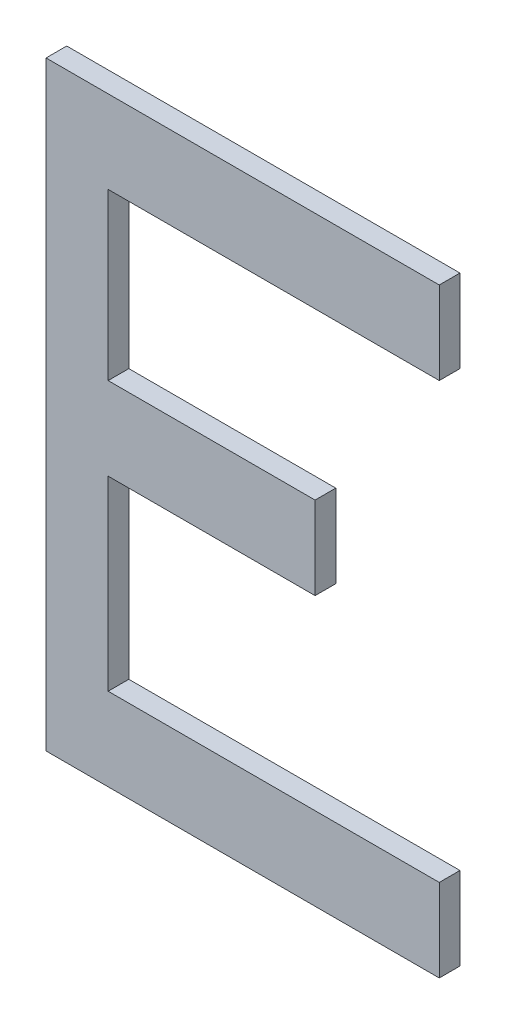
ISO-10303-21;
HEADER;
FILE_DESCRIPTION(('STEP AP214'),'2;1');
FILE_NAME('part.step','',(''),(''),'','','');
FILE_SCHEMA(('AUTOMOTIVE_DESIGN { 1 0 10303 214 1 1 1 1 }'));
ENDSEC;
DATA;
#1=APPLICATION_CONTEXT('core data for automotive mechanical design processes');
#2=APPLICATION_PROTOCOL_DEFINITION('international standard','automotive_design',2000,#1);
#3=PRODUCT_CONTEXT('',#1,'mechanical');
#4=PRODUCT('Part','Part','',(#3));
#5=PRODUCT_RELATED_PRODUCT_CATEGORY('part','',(#4));
#6=PRODUCT_DEFINITION_FORMATION('','',#4);
#7=PRODUCT_DEFINITION_CONTEXT('part definition',#1,'design');
#8=PRODUCT_DEFINITION('design','',#6,#7);
#9=PRODUCT_DEFINITION_SHAPE('','',#8);
#10=(LENGTH_UNIT() NAMED_UNIT(*) SI_UNIT(.MILLI.,.METRE.));
#11=(NAMED_UNIT(*) PLANE_ANGLE_UNIT() SI_UNIT($,.RADIAN.));
#12=(NAMED_UNIT(*) SI_UNIT($,.STERADIAN.) SOLID_ANGLE_UNIT());
#13=UNCERTAINTY_MEASURE_WITH_UNIT(LENGTH_MEASURE(1.E-05),#10,'distance_accuracy_value','');
#14=(GEOMETRIC_REPRESENTATION_CONTEXT(3) GLOBAL_UNCERTAINTY_ASSIGNED_CONTEXT((#13)) GLOBAL_UNIT_ASSIGNED_CONTEXT((#10,
#11,#12)) REPRESENTATION_CONTEXT('',''));
#15=CARTESIAN_POINT('',(0.,0.,0.));
#16=DIRECTION('',(0.,0.,1.));
#17=DIRECTION('',(1.,0.,0.));
#18=AXIS2_PLACEMENT_3D('',#15,#16,#17);
#19=CARTESIAN_POINT('',(-0.09499853999999,0.14500098,0.01));
#20=DIRECTION('',(0.,0.,1.));
#21=DIRECTION('',(1.,0.,0.));
#22=AXIS2_PLACEMENT_3D('',#19,#20,#21);
#23=PLANE('',#22);
#24=DIRECTION('',(0.,1.,0.));
#25=VECTOR('',#24,1.);
#26=CARTESIAN_POINT('',(0.09500108,0.14500098,0.01));
#27=LINE('',#26,#25);
#28=CARTESIAN_POINT('',(0.09500108,0.14500098,0.01));
#29=VERTEX_POINT('',#28);
#30=CARTESIAN_POINT('',(0.09500108,0.10500106,0.01));
#31=VERTEX_POINT('',#30);
#32=EDGE_CURVE('E156',#29,#31,#27,.F.);
#33=ORIENTED_EDGE('',*,*,#32,.F.);
#34=DIRECTION('',(1.,0.,0.));
#35=VECTOR('',#34,1.);
#36=CARTESIAN_POINT('',(-0.09499853999999,0.14500098,0.01));
#37=LINE('',#36,#35);
#38=CARTESIAN_POINT('',(-0.09499853999999,0.14500098,0.01));
#39=VERTEX_POINT('',#38);
#40=EDGE_CURVE('E117',#39,#29,#37,.T.);
#41=ORIENTED_EDGE('',*,*,#40,.F.);
#42=DIRECTION('',(0.,1.,0.));
#43=VECTOR('',#42,1.);
#44=CARTESIAN_POINT('',(-0.09499853999999,-0.14499844,0.01));
#45=LINE('',#44,#43);
#46=CARTESIAN_POINT('',(-0.09499853999999,-0.14499844,0.01));
#47=VERTEX_POINT('',#46);
#48=EDGE_CURVE('E19',#47,#39,#45,.T.);
#49=ORIENTED_EDGE('',*,*,#48,.F.);
#50=DIRECTION('',(1.,0.,0.));
#51=VECTOR('',#50,1.);
#52=CARTESIAN_POINT('',(0.09500108,-0.14499844,0.01));
#53=LINE('',#52,#51);
#54=CARTESIAN_POINT('',(0.09500108,-0.14499844,0.01));
#55=VERTEX_POINT('',#54);
#56=EDGE_CURVE('E106',#55,#47,#53,.F.);
#57=ORIENTED_EDGE('',*,*,#56,.F.);
#58=DIRECTION('',(0.,1.,0.));
#59=VECTOR('',#58,1.);
#60=CARTESIAN_POINT('',(0.09500108,-0.10499852,0.01));
#61=LINE('',#60,#59);
#62=CARTESIAN_POINT('',(0.09500108,-0.10499852,0.01));
#63=VERTEX_POINT('',#62);
#64=EDGE_CURVE('E101',#63,#55,#61,.F.);
#65=ORIENTED_EDGE('',*,*,#64,.F.);
#66=DIRECTION('',(1.,0.,0.));
#67=VECTOR('',#66,1.);
#68=CARTESIAN_POINT('',(-0.0649986,-0.10499852,0.01));
#69=LINE('',#68,#67);
#70=CARTESIAN_POINT('',(-0.0649986,-0.10499852,0.01));
#71=VERTEX_POINT('',#70);
#72=EDGE_CURVE('E128',#71,#63,#69,.T.);
#73=ORIENTED_EDGE('',*,*,#72,.F.);
#74=DIRECTION('',(0.,1.,0.));
#75=VECTOR('',#74,1.);
#76=CARTESIAN_POINT('',(-0.0649986,-0.01499869999999,0.01));
#77=LINE('',#76,#75);
#78=CARTESIAN_POINT('',(-0.0649986,-0.01499869999999,0.01));
#79=VERTEX_POINT('',#78);
#80=EDGE_CURVE('E132',#79,#71,#77,.F.);
#81=ORIENTED_EDGE('',*,*,#80,.F.);
#82=DIRECTION('',(1.,0.,0.));
#83=VECTOR('',#82,1.);
#84=CARTESIAN_POINT('',(0.0350012,-0.01499869999999,0.01));
#85=LINE('',#84,#83);
#86=CARTESIAN_POINT('',(0.0350012,-0.01499869999999,0.01));
#87=VERTEX_POINT('',#86);
#88=EDGE_CURVE('E136',#87,#79,#85,.F.);
#89=ORIENTED_EDGE('',*,*,#88,.F.);
#90=DIRECTION('',(0.,1.,0.));
#91=VECTOR('',#90,1.);
#92=CARTESIAN_POINT('',(0.0350012,0.02500122000001,0.01));
#93=LINE('',#92,#91);
#94=CARTESIAN_POINT('',(0.0350012,0.02500122000001,0.01));
#95=VERTEX_POINT('',#94);
#96=EDGE_CURVE('E140',#95,#87,#93,.F.);
#97=ORIENTED_EDGE('',*,*,#96,.F.);
#98=DIRECTION('',(1.,0.,0.));
#99=VECTOR('',#98,1.);
#100=CARTESIAN_POINT('',(-0.0649986,0.02500122000001,0.01));
#101=LINE('',#100,#99);
#102=CARTESIAN_POINT('',(-0.0649986,0.02500122000001,0.01));
#103=VERTEX_POINT('',#102);
#104=EDGE_CURVE('E144',#103,#95,#101,.T.);
#105=ORIENTED_EDGE('',*,*,#104,.F.);
#106=DIRECTION('',(0.,1.,0.));
#107=VECTOR('',#106,1.);
#108=CARTESIAN_POINT('',(-0.0649986,0.10500106,0.01));
#109=LINE('',#108,#107);
#110=CARTESIAN_POINT('',(-0.0649986,0.10500106,0.01));
#111=VERTEX_POINT('',#110);
#112=EDGE_CURVE('E148',#111,#103,#109,.F.);
#113=ORIENTED_EDGE('',*,*,#112,.F.);
#114=DIRECTION('',(1.,0.,0.));
#115=VECTOR('',#114,1.);
#116=CARTESIAN_POINT('',(0.09500108,0.10500106,0.01));
#117=LINE('',#116,#115);
#118=EDGE_CURVE('E152',#31,#111,#117,.F.);
#119=ORIENTED_EDGE('',*,*,#118,.F.);
#120=EDGE_LOOP('',(#33,#41,#49,#57,#65,#73,#81,#89,#97,#105,#113,#119));
#121=FACE_BOUND('',#120,.T.);
#122=ADVANCED_FACE('F16',(#121),#23,.T.);
#123=CARTESIAN_POINT('',(-0.09499853999999,-0.14499844,0.));
#124=DIRECTION('',(-1.,0.,0.));
#125=DIRECTION('',(0.,0.,1.));
#126=AXIS2_PLACEMENT_3D('',#123,#124,#125);
#127=PLANE('',#126);
#128=DIRECTION('',(0.,0.,1.));
#129=VECTOR('',#128,1.);
#130=CARTESIAN_POINT('',(-0.09499853999999,0.14500098,0.));
#131=LINE('',#130,#129);
#132=CARTESIAN_POINT('',(-0.09499853999999,0.14500098,0.));
#133=VERTEX_POINT('',#132);
#134=EDGE_CURVE('E160',#133,#39,#131,.T.);
#135=ORIENTED_EDGE('',*,*,#134,.F.);
#136=DIRECTION('',(0.,1.,0.));
#137=VECTOR('',#136,1.);
#138=CARTESIAN_POINT('',(-0.09499853999999,0.14500098,0.));
#139=LINE('',#138,#137);
#140=CARTESIAN_POINT('',(-0.09499853999999,-0.14499844,0.));
#141=VERTEX_POINT('',#140);
#142=EDGE_CURVE('E123',#133,#141,#139,.F.);
#143=ORIENTED_EDGE('',*,*,#142,.T.);
#144=DIRECTION('',(0.,0.,-1.));
#145=VECTOR('',#144,1.);
#146=CARTESIAN_POINT('',(-0.09499853999999,-0.14499844,0.));
#147=LINE('',#146,#145);
#148=EDGE_CURVE('E111',#47,#141,#147,.T.);
#149=ORIENTED_EDGE('',*,*,#148,.F.);
#150=ORIENTED_EDGE('',*,*,#48,.T.);
#151=EDGE_LOOP('',(#135,#143,#149,#150));
#152=FACE_BOUND('',#151,.T.);
#153=ADVANCED_FACE('F122',(#152),#127,.T.);
#154=CARTESIAN_POINT('',(0.09500108,-0.14499844,0.));
#155=DIRECTION('',(0.,-1.,0.));
#156=DIRECTION('',(0.,0.,-1.));
#157=AXIS2_PLACEMENT_3D('',#154,#155,#156);
#158=PLANE('',#157);
#159=ORIENTED_EDGE('',*,*,#148,.T.);
#160=DIRECTION('',(1.,0.,0.));
#161=VECTOR('',#160,1.);
#162=CARTESIAN_POINT('',(-0.09499853999999,-0.14499844,0.));
#163=LINE('',#162,#161);
#164=CARTESIAN_POINT('',(0.09500108,-0.14499844,0.));
#165=VERTEX_POINT('',#164);
#166=EDGE_CURVE('E165',#141,#165,#163,.T.);
#167=ORIENTED_EDGE('',*,*,#166,.T.);
#168=DIRECTION('',(0.,0.,-1.));
#169=VECTOR('',#168,1.);
#170=CARTESIAN_POINT('',(0.09500108,-0.14499844,0.));
#171=LINE('',#170,#169);
#172=EDGE_CURVE('E113',#55,#165,#171,.T.);
#173=ORIENTED_EDGE('',*,*,#172,.F.);
#174=ORIENTED_EDGE('',*,*,#56,.T.);
#175=EDGE_LOOP('',(#159,#167,#173,#174));
#176=FACE_BOUND('',#175,.T.);
#177=ADVANCED_FACE('F108',(#176),#158,.T.);
#178=CARTESIAN_POINT('',(0.09500108,-0.10499852,0.));
#179=DIRECTION('',(1.,0.,0.));
#180=DIRECTION('',(0.,0.,-1.));
#181=AXIS2_PLACEMENT_3D('',#178,#179,#180);
#182=PLANE('',#181);
#183=ORIENTED_EDGE('',*,*,#172,.T.);
#184=DIRECTION('',(0.,1.,0.));
#185=VECTOR('',#184,1.);
#186=CARTESIAN_POINT('',(0.09500108,0.14500098,0.));
#187=LINE('',#186,#185);
#188=CARTESIAN_POINT('',(0.09500108,-0.10499852,0.));
#189=VERTEX_POINT('',#188);
#190=EDGE_CURVE('E167',#165,#189,#187,.T.);
#191=ORIENTED_EDGE('',*,*,#190,.T.);
#192=DIRECTION('',(0.,0.,1.));
#193=VECTOR('',#192,1.);
#194=CARTESIAN_POINT('',(0.09500108,-0.10499852,0.));
#195=LINE('',#194,#193);
#196=EDGE_CURVE('E130',#63,#189,#195,.F.);
#197=ORIENTED_EDGE('',*,*,#196,.F.);
#198=ORIENTED_EDGE('',*,*,#64,.T.);
#199=EDGE_LOOP('',(#183,#191,#197,#198));
#200=FACE_BOUND('',#199,.T.);
#201=ADVANCED_FACE('F233',(#200),#182,.T.);
#202=CARTESIAN_POINT('',(-0.0649986,-0.10499852,0.));
#203=DIRECTION('',(0.,1.,0.));
#204=DIRECTION('',(0.,0.,1.));
#205=AXIS2_PLACEMENT_3D('',#202,#203,#204);
#206=PLANE('',#205);
#207=ORIENTED_EDGE('',*,*,#196,.T.);
#208=DIRECTION('',(1.,0.,0.));
#209=VECTOR('',#208,1.);
#210=CARTESIAN_POINT('',(-0.09499853999999,-0.10499852,0.));
#211=LINE('',#210,#209);
#212=CARTESIAN_POINT('',(-0.0649986,-0.10499852,0.));
#213=VERTEX_POINT('',#212);
#214=EDGE_CURVE('E170',#189,#213,#211,.F.);
#215=ORIENTED_EDGE('',*,*,#214,.T.);
#216=DIRECTION('',(0.,0.,-1.));
#217=VECTOR('',#216,1.);
#218=CARTESIAN_POINT('',(-0.0649986,-0.10499852,0.));
#219=LINE('',#218,#217);
#220=EDGE_CURVE('E134',#71,#213,#219,.T.);
#221=ORIENTED_EDGE('',*,*,#220,.F.);
#222=ORIENTED_EDGE('',*,*,#72,.T.);
#223=EDGE_LOOP('',(#207,#215,#221,#222));
#224=FACE_BOUND('',#223,.T.);
#225=ADVANCED_FACE('F232',(#224),#206,.T.);
#226=CARTESIAN_POINT('',(-0.0649986,-0.01499869999999,0.));
#227=DIRECTION('',(1.,0.,0.));
#228=DIRECTION('',(0.,0.,-1.));
#229=AXIS2_PLACEMENT_3D('',#226,#227,#228);
#230=PLANE('',#229);
#231=ORIENTED_EDGE('',*,*,#220,.T.);
#232=DIRECTION('',(0.,1.,0.));
#233=VECTOR('',#232,1.);
#234=CARTESIAN_POINT('',(-0.0649986,0.14500098,0.));
#235=LINE('',#234,#233);
#236=CARTESIAN_POINT('',(-0.0649986,-0.01499869999999,0.));
#237=VERTEX_POINT('',#236);
#238=EDGE_CURVE('E173',#213,#237,#235,.T.);
#239=ORIENTED_EDGE('',*,*,#238,.T.);
#240=DIRECTION('',(0.,0.,-1.));
#241=VECTOR('',#240,1.);
#242=CARTESIAN_POINT('',(-0.0649986,-0.01499869999999,0.));
#243=LINE('',#242,#241);
#244=EDGE_CURVE('E138',#79,#237,#243,.T.);
#245=ORIENTED_EDGE('',*,*,#244,.F.);
#246=ORIENTED_EDGE('',*,*,#80,.T.);
#247=EDGE_LOOP('',(#231,#239,#245,#246));
#248=FACE_BOUND('',#247,.T.);
#249=ADVANCED_FACE('F226',(#248),#230,.T.);
#250=CARTESIAN_POINT('',(0.0350012,-0.01499869999999,0.));
#251=DIRECTION('',(0.,-1.,0.));
#252=DIRECTION('',(0.,0.,-1.));
#253=AXIS2_PLACEMENT_3D('',#250,#251,#252);
#254=PLANE('',#253);
#255=ORIENTED_EDGE('',*,*,#244,.T.);
#256=DIRECTION('',(1.,0.,0.));
#257=VECTOR('',#256,1.);
#258=CARTESIAN_POINT('',(-0.09499853999999,-0.01499869999999,0.));
#259=LINE('',#258,#257);
#260=CARTESIAN_POINT('',(0.0350012,-0.01499869999999,0.));
#261=VERTEX_POINT('',#260);
#262=EDGE_CURVE('E176',#237,#261,#259,.T.);
#263=ORIENTED_EDGE('',*,*,#262,.T.);
#264=DIRECTION('',(0.,0.,-1.));
#265=VECTOR('',#264,1.);
#266=CARTESIAN_POINT('',(0.0350012,-0.01499869999999,0.));
#267=LINE('',#266,#265);
#268=EDGE_CURVE('E142',#87,#261,#267,.T.);
#269=ORIENTED_EDGE('',*,*,#268,.F.);
#270=ORIENTED_EDGE('',*,*,#88,.T.);
#271=EDGE_LOOP('',(#255,#263,#269,#270));
#272=FACE_BOUND('',#271,.T.);
#273=ADVANCED_FACE('F222',(#272),#254,.T.);
#274=CARTESIAN_POINT('',(0.0350012,0.02500122000001,0.));
#275=DIRECTION('',(1.,0.,0.));
#276=DIRECTION('',(0.,0.,-1.));
#277=AXIS2_PLACEMENT_3D('',#274,#275,#276);
#278=PLANE('',#277);
#279=ORIENTED_EDGE('',*,*,#268,.T.);
#280=DIRECTION('',(0.,1.,0.));
#281=VECTOR('',#280,1.);
#282=CARTESIAN_POINT('',(0.0350012,0.14500098,0.));
#283=LINE('',#282,#281);
#284=CARTESIAN_POINT('',(0.0350012,0.02500122000001,0.));
#285=VERTEX_POINT('',#284);
#286=EDGE_CURVE('E179',#261,#285,#283,.T.);
#287=ORIENTED_EDGE('',*,*,#286,.T.);
#288=DIRECTION('',(0.,0.,1.));
#289=VECTOR('',#288,1.);
#290=CARTESIAN_POINT('',(0.0350012,0.02500122000001,0.));
#291=LINE('',#290,#289);
#292=EDGE_CURVE('E146',#95,#285,#291,.F.);
#293=ORIENTED_EDGE('',*,*,#292,.F.);
#294=ORIENTED_EDGE('',*,*,#96,.T.);
#295=EDGE_LOOP('',(#279,#287,#293,#294));
#296=FACE_BOUND('',#295,.T.);
#297=ADVANCED_FACE('F216',(#296),#278,.T.);
#298=CARTESIAN_POINT('',(-0.0649986,0.02500122000001,0.));
#299=DIRECTION('',(0.,1.,0.));
#300=DIRECTION('',(0.,0.,1.));
#301=AXIS2_PLACEMENT_3D('',#298,#299,#300);
#302=PLANE('',#301);
#303=ORIENTED_EDGE('',*,*,#292,.T.);
#304=DIRECTION('',(1.,0.,0.));
#305=VECTOR('',#304,1.);
#306=CARTESIAN_POINT('',(-0.09499853999999,0.02500122000001,0.));
#307=LINE('',#306,#305);
#308=CARTESIAN_POINT('',(-0.0649986,0.02500122000001,0.));
#309=VERTEX_POINT('',#308);
#310=EDGE_CURVE('E182',#285,#309,#307,.F.);
#311=ORIENTED_EDGE('',*,*,#310,.T.);
#312=DIRECTION('',(0.,0.,-1.));
#313=VECTOR('',#312,1.);
#314=CARTESIAN_POINT('',(-0.0649986,0.02500122000001,0.));
#315=LINE('',#314,#313);
#316=EDGE_CURVE('E150',#103,#309,#315,.T.);
#317=ORIENTED_EDGE('',*,*,#316,.F.);
#318=ORIENTED_EDGE('',*,*,#104,.T.);
#319=EDGE_LOOP('',(#303,#311,#317,#318));
#320=FACE_BOUND('',#319,.T.);
#321=ADVANCED_FACE('F212',(#320),#302,.T.);
#322=CARTESIAN_POINT('',(-0.0649986,0.10500106,0.));
#323=DIRECTION('',(1.,0.,0.));
#324=DIRECTION('',(0.,0.,-1.));
#325=AXIS2_PLACEMENT_3D('',#322,#323,#324);
#326=PLANE('',#325);
#327=ORIENTED_EDGE('',*,*,#316,.T.);
#328=DIRECTION('',(0.,1.,0.));
#329=VECTOR('',#328,1.);
#330=CARTESIAN_POINT('',(-0.0649986,0.14500098,0.));
#331=LINE('',#330,#329);
#332=CARTESIAN_POINT('',(-0.0649986,0.10500106,0.));
#333=VERTEX_POINT('',#332);
#334=EDGE_CURVE('E185',#309,#333,#331,.T.);
#335=ORIENTED_EDGE('',*,*,#334,.T.);
#336=DIRECTION('',(0.,0.,-1.));
#337=VECTOR('',#336,1.);
#338=CARTESIAN_POINT('',(-0.0649986,0.10500106,0.));
#339=LINE('',#338,#337);
#340=EDGE_CURVE('E154',#111,#333,#339,.T.);
#341=ORIENTED_EDGE('',*,*,#340,.F.);
#342=ORIENTED_EDGE('',*,*,#112,.T.);
#343=EDGE_LOOP('',(#327,#335,#341,#342));
#344=FACE_BOUND('',#343,.T.);
#345=ADVANCED_FACE('F206',(#344),#326,.T.);
#346=CARTESIAN_POINT('',(0.09500108,0.10500106,0.));
#347=DIRECTION('',(0.,-1.,0.));
#348=DIRECTION('',(0.,0.,-1.));
#349=AXIS2_PLACEMENT_3D('',#346,#347,#348);
#350=PLANE('',#349);
#351=ORIENTED_EDGE('',*,*,#340,.T.);
#352=DIRECTION('',(1.,0.,0.));
#353=VECTOR('',#352,1.);
#354=CARTESIAN_POINT('',(-0.09499853999999,0.10500106,0.));
#355=LINE('',#354,#353);
#356=CARTESIAN_POINT('',(0.09500108,0.10500106,0.));
#357=VERTEX_POINT('',#356);
#358=EDGE_CURVE('E188',#333,#357,#355,.T.);
#359=ORIENTED_EDGE('',*,*,#358,.T.);
#360=DIRECTION('',(0.,0.,-1.));
#361=VECTOR('',#360,1.);
#362=CARTESIAN_POINT('',(0.09500108,0.10500106,0.));
#363=LINE('',#362,#361);
#364=EDGE_CURVE('E158',#31,#357,#363,.T.);
#365=ORIENTED_EDGE('',*,*,#364,.F.);
#366=ORIENTED_EDGE('',*,*,#118,.T.);
#367=EDGE_LOOP('',(#351,#359,#365,#366));
#368=FACE_BOUND('',#367,.T.);
#369=ADVANCED_FACE('F201',(#368),#350,.T.);
#370=CARTESIAN_POINT('',(0.09500108,0.14500098,0.));
#371=DIRECTION('',(1.,0.,0.));
#372=DIRECTION('',(0.,0.,-1.));
#373=AXIS2_PLACEMENT_3D('',#370,#371,#372);
#374=PLANE('',#373);
#375=ORIENTED_EDGE('',*,*,#364,.T.);
#376=DIRECTION('',(0.,1.,0.));
#377=VECTOR('',#376,1.);
#378=CARTESIAN_POINT('',(0.09500108,0.14500098,0.));
#379=LINE('',#378,#377);
#380=CARTESIAN_POINT('',(0.09500108,0.14500098,0.));
#381=VERTEX_POINT('',#380);
#382=EDGE_CURVE('E25',#357,#381,#379,.T.);
#383=ORIENTED_EDGE('',*,*,#382,.T.);
#384=DIRECTION('',(0.,0.,1.));
#385=VECTOR('',#384,1.);
#386=CARTESIAN_POINT('',(0.09500108,0.14500098,0.));
#387=LINE('',#386,#385);
#388=EDGE_CURVE('E33',#29,#381,#387,.F.);
#389=ORIENTED_EDGE('',*,*,#388,.F.);
#390=ORIENTED_EDGE('',*,*,#32,.T.);
#391=EDGE_LOOP('',(#375,#383,#389,#390));
#392=FACE_BOUND('',#391,.T.);
#393=ADVANCED_FACE('F194',(#392),#374,.T.);
#394=CARTESIAN_POINT('',(-0.09499853999999,0.14500098,0.));
#395=DIRECTION('',(0.,1.,0.));
#396=DIRECTION('',(0.,0.,1.));
#397=AXIS2_PLACEMENT_3D('',#394,#395,#396);
#398=PLANE('',#397);
#399=ORIENTED_EDGE('',*,*,#388,.T.);
#400=DIRECTION('',(1.,0.,0.));
#401=VECTOR('',#400,1.);
#402=CARTESIAN_POINT('',(-0.09499853999999,0.14500098,0.));
#403=LINE('',#402,#401);
#404=EDGE_CURVE('E11',#381,#133,#403,.F.);
#405=ORIENTED_EDGE('',*,*,#404,.T.);
#406=ORIENTED_EDGE('',*,*,#134,.T.);
#407=ORIENTED_EDGE('',*,*,#40,.T.);
#408=EDGE_LOOP('',(#399,#405,#406,#407));
#409=FACE_BOUND('',#408,.T.);
#410=ADVANCED_FACE('F234',(#409),#398,.T.);
#411=CARTESIAN_POINT('',(-0.09499853999999,0.14500098,0.));
#412=DIRECTION('',(0.,0.,1.));
#413=DIRECTION('',(1.,0.,0.));
#414=AXIS2_PLACEMENT_3D('',#411,#412,#413);
#415=PLANE('',#414);
#416=ORIENTED_EDGE('',*,*,#382,.F.);
#417=ORIENTED_EDGE('',*,*,#358,.F.);
#418=ORIENTED_EDGE('',*,*,#334,.F.);
#419=ORIENTED_EDGE('',*,*,#310,.F.);
#420=ORIENTED_EDGE('',*,*,#286,.F.);
#421=ORIENTED_EDGE('',*,*,#262,.F.);
#422=ORIENTED_EDGE('',*,*,#238,.F.);
#423=ORIENTED_EDGE('',*,*,#214,.F.);
#424=ORIENTED_EDGE('',*,*,#190,.F.);
#425=ORIENTED_EDGE('',*,*,#166,.F.);
#426=ORIENTED_EDGE('',*,*,#142,.F.);
#427=ORIENTED_EDGE('',*,*,#404,.F.);
#428=EDGE_LOOP('',(#416,#417,#418,#419,#420,#421,#422,#423,#424,#425,#426,#427));
#429=FACE_BOUND('',#428,.T.);
#430=ADVANCED_FACE('F198',(#429),#415,.F.);
#431=CLOSED_SHELL('',(#122,#153,#177,#201,#225,#249,#273,#297,#321,#345,#369,#393,#410,#430));
#432=MANIFOLD_SOLID_BREP('B1',#431);
#433=ADVANCED_BREP_SHAPE_REPRESENTATION('',(#18,#432),#14);
#434=SHAPE_DEFINITION_REPRESENTATION(#9,#433);
ENDSEC;
END-ISO-10303-21;
